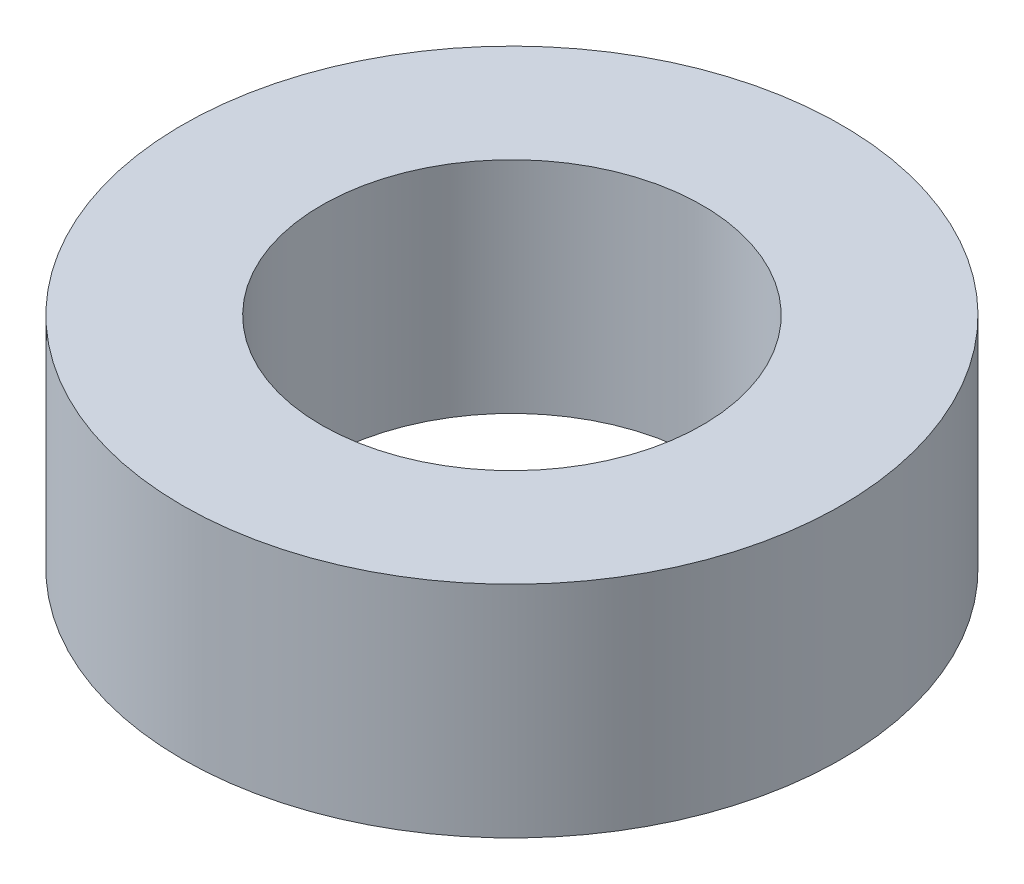
ISO-10303-21;
HEADER;
FILE_DESCRIPTION(('STEP AP214'),'2;1');
FILE_NAME('part.step','',(''),(''),'','','');
FILE_SCHEMA(('AUTOMOTIVE_DESIGN { 1 0 10303 214 1 1 1 1 }'));
ENDSEC;
DATA;
#1=APPLICATION_CONTEXT('core data for automotive mechanical design processes');
#2=APPLICATION_PROTOCOL_DEFINITION('international standard','automotive_design',2000,#1);
#3=PRODUCT_CONTEXT('',#1,'mechanical');
#4=PRODUCT('Part','Part','',(#3));
#5=PRODUCT_RELATED_PRODUCT_CATEGORY('part','',(#4));
#6=PRODUCT_DEFINITION_FORMATION('','',#4);
#7=PRODUCT_DEFINITION_CONTEXT('part definition',#1,'design');
#8=PRODUCT_DEFINITION('design','',#6,#7);
#9=PRODUCT_DEFINITION_SHAPE('','',#8);
#10=(LENGTH_UNIT() NAMED_UNIT(*) SI_UNIT(.MILLI.,.METRE.));
#11=(NAMED_UNIT(*) PLANE_ANGLE_UNIT() SI_UNIT($,.RADIAN.));
#12=(NAMED_UNIT(*) SI_UNIT($,.STERADIAN.) SOLID_ANGLE_UNIT());
#13=UNCERTAINTY_MEASURE_WITH_UNIT(LENGTH_MEASURE(1.E-05),#10,'distance_accuracy_value','');
#14=(GEOMETRIC_REPRESENTATION_CONTEXT(3) GLOBAL_UNCERTAINTY_ASSIGNED_CONTEXT((#13)) GLOBAL_UNIT_ASSIGNED_CONTEXT((#10,
#11,#12)) REPRESENTATION_CONTEXT('',''));
#15=CARTESIAN_POINT('',(0.,0.,0.));
#16=DIRECTION('',(0.,0.,1.));
#17=DIRECTION('',(1.,0.,0.));
#18=AXIS2_PLACEMENT_3D('',#15,#16,#17);
#19=CARTESIAN_POINT('',(0.,15.,0.));
#20=DIRECTION('',(0.,1.,0.));
#21=DIRECTION('',(0.,0.,1.));
#22=AXIS2_PLACEMENT_3D('',#19,#20,#21);
#23=PLANE('',#22);
#24=CARTESIAN_POINT('',(0.,15.,0.));
#25=DIRECTION('',(0.,1.,0.));
#26=DIRECTION('',(0.,0.,1.));
#27=AXIS2_PLACEMENT_3D('',#24,#25,#26);
#28=CIRCLE('',#27,22.5);
#29=CARTESIAN_POINT('',(0.,15.,22.5));
#30=VERTEX_POINT('',#29);
#31=EDGE_CURVE('E10',#30,#30,#28,.T.);
#32=ORIENTED_EDGE('',*,*,#31,.T.);
#33=EDGE_LOOP('',(#32));
#34=FACE_BOUND('',#33,.T.);
#35=CARTESIAN_POINT('',(0.,15.,0.));
#36=DIRECTION('',(0.,1.,0.));
#37=DIRECTION('',(0.,0.,1.));
#38=AXIS2_PLACEMENT_3D('',#35,#36,#37);
#39=CIRCLE('',#38,13.);
#40=CARTESIAN_POINT('',(0.,15.,13.));
#41=VERTEX_POINT('',#40);
#42=EDGE_CURVE('E44',#41,#41,#39,.T.);
#43=ORIENTED_EDGE('',*,*,#42,.F.);
#44=EDGE_LOOP('',(#43));
#45=FACE_BOUND('',#44,.T.);
#46=ADVANCED_FACE('F33',(#34,#45),#23,.T.);
#47=CARTESIAN_POINT('',(0.,0.,0.));
#48=DIRECTION('',(0.,1.,0.));
#49=DIRECTION('',(0.,0.,1.));
#50=AXIS2_PLACEMENT_3D('',#47,#48,#49);
#51=PLANE('',#50);
#52=CARTESIAN_POINT('',(0.,0.,0.));
#53=DIRECTION('',(0.,1.,0.));
#54=DIRECTION('',(0.,0.,1.));
#55=AXIS2_PLACEMENT_3D('',#52,#53,#54);
#56=CIRCLE('',#55,22.5);
#57=CARTESIAN_POINT('',(0.,0.,22.5));
#58=VERTEX_POINT('',#57);
#59=EDGE_CURVE('E37',#58,#58,#56,.T.);
#60=ORIENTED_EDGE('',*,*,#59,.F.);
#61=EDGE_LOOP('',(#60));
#62=FACE_BOUND('',#61,.T.);
#63=CARTESIAN_POINT('',(0.,0.,0.));
#64=DIRECTION('',(0.,1.,0.));
#65=DIRECTION('',(0.,0.,1.));
#66=AXIS2_PLACEMENT_3D('',#63,#64,#65);
#67=CIRCLE('',#66,13.);
#68=CARTESIAN_POINT('',(0.,0.,13.));
#69=VERTEX_POINT('',#68);
#70=EDGE_CURVE('E46',#69,#69,#67,.T.);
#71=ORIENTED_EDGE('',*,*,#70,.T.);
#72=EDGE_LOOP('',(#71));
#73=FACE_BOUND('',#72,.T.);
#74=ADVANCED_FACE('F56',(#62,#73),#51,.F.);
#75=CARTESIAN_POINT('',(0.,15.,0.));
#76=DIRECTION('',(0.,-1.,0.));
#77=DIRECTION('',(0.,0.,-1.));
#78=AXIS2_PLACEMENT_3D('',#75,#76,#77);
#79=CYLINDRICAL_SURFACE('',#78,22.5);
#80=ORIENTED_EDGE('',*,*,#31,.F.);
#81=EDGE_LOOP('',(#80));
#82=FACE_BOUND('',#81,.T.);
#83=ORIENTED_EDGE('',*,*,#59,.T.);
#84=EDGE_LOOP('',(#83));
#85=FACE_BOUND('',#84,.T.);
#86=ADVANCED_FACE('F35',(#82,#85),#79,.T.);
#87=CARTESIAN_POINT('',(0.,15.,0.));
#88=DIRECTION('',(0.,-1.,0.));
#89=DIRECTION('',(0.,0.,-1.));
#90=AXIS2_PLACEMENT_3D('',#87,#88,#89);
#91=CYLINDRICAL_SURFACE('',#90,13.);
#92=ORIENTED_EDGE('',*,*,#42,.T.);
#93=EDGE_LOOP('',(#92));
#94=FACE_BOUND('',#93,.T.);
#95=ORIENTED_EDGE('',*,*,#70,.F.);
#96=EDGE_LOOP('',(#95));
#97=FACE_BOUND('',#96,.T.);
#98=ADVANCED_FACE('F52',(#94,#97),#91,.F.);
#99=CLOSED_SHELL('',(#46,#74,#86,#98));
#100=MANIFOLD_SOLID_BREP('B2',#99);
#101=ADVANCED_BREP_SHAPE_REPRESENTATION('',(#18,#100),#14);
#102=SHAPE_DEFINITION_REPRESENTATION(#9,#101);
ENDSEC;
END-ISO-10303-21;
